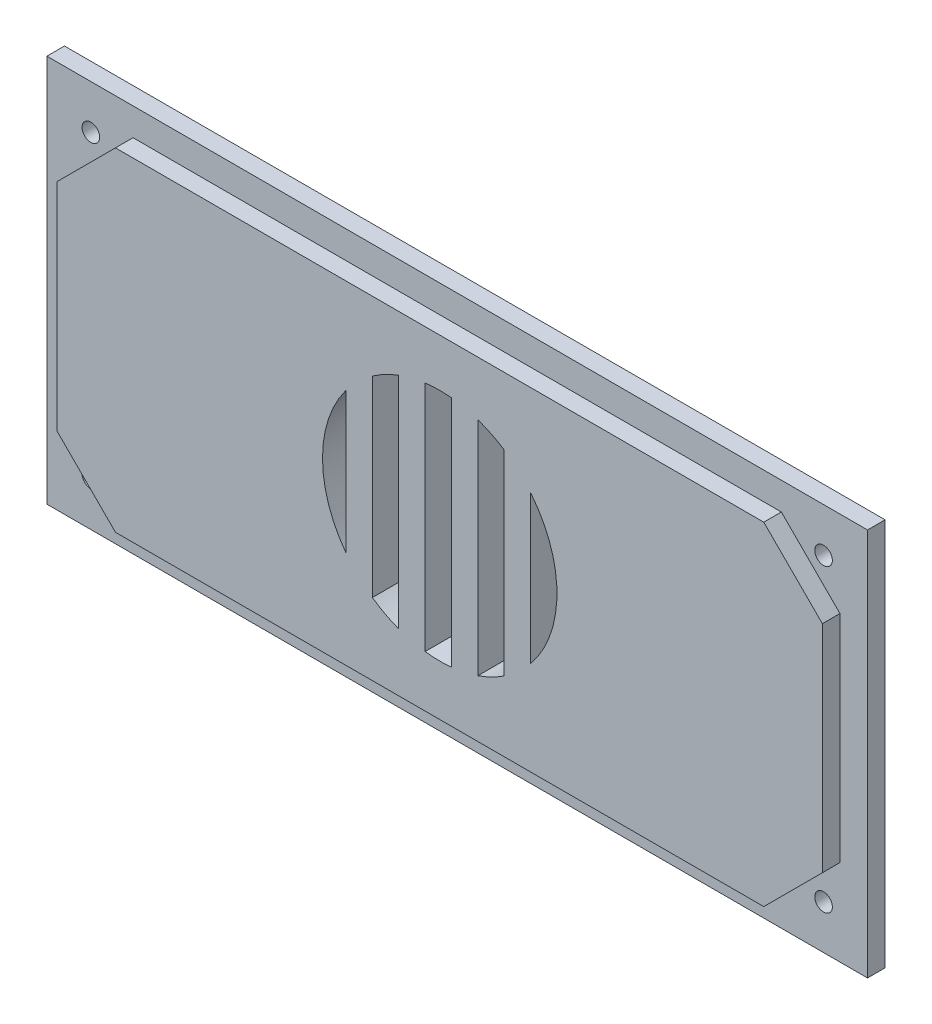
ISO-10303-21;
HEADER;
FILE_DESCRIPTION(('STEP AP214'),'2;1');
FILE_NAME('part.step','',(''),(''),'','','');
FILE_SCHEMA(('AUTOMOTIVE_DESIGN { 1 0 10303 214 1 1 1 1 }'));
ENDSEC;
DATA;
#1=APPLICATION_CONTEXT('core data for automotive mechanical design processes');
#2=APPLICATION_PROTOCOL_DEFINITION('international standard','automotive_design',2000,#1);
#3=PRODUCT_CONTEXT('',#1,'mechanical');
#4=PRODUCT('Part','Part','',(#3));
#5=PRODUCT_RELATED_PRODUCT_CATEGORY('part','',(#4));
#6=PRODUCT_DEFINITION_FORMATION('','',#4);
#7=PRODUCT_DEFINITION_CONTEXT('part definition',#1,'design');
#8=PRODUCT_DEFINITION('design','',#6,#7);
#9=PRODUCT_DEFINITION_SHAPE('','',#8);
#10=(LENGTH_UNIT() NAMED_UNIT(*) SI_UNIT(.MILLI.,.METRE.));
#11=(NAMED_UNIT(*) PLANE_ANGLE_UNIT() SI_UNIT($,.RADIAN.));
#12=(NAMED_UNIT(*) SI_UNIT($,.STERADIAN.) SOLID_ANGLE_UNIT());
#13=UNCERTAINTY_MEASURE_WITH_UNIT(LENGTH_MEASURE(1.E-05),#10,'distance_accuracy_value','');
#14=(GEOMETRIC_REPRESENTATION_CONTEXT(3) GLOBAL_UNCERTAINTY_ASSIGNED_CONTEXT((#13)) GLOBAL_UNIT_ASSIGNED_CONTEXT((#10,
#11,#12)) REPRESENTATION_CONTEXT('',''));
#15=CARTESIAN_POINT('',(0.,0.,0.));
#16=DIRECTION('',(0.,0.,1.));
#17=DIRECTION('',(1.,0.,0.));
#18=AXIS2_PLACEMENT_3D('',#15,#16,#17);
#19=CARTESIAN_POINT('',(62.5,-25.6,3.));
#20=DIRECTION('',(0.,0.,-1.));
#21=DIRECTION('',(-1.,0.,0.));
#22=AXIS2_PLACEMENT_3D('',#19,#20,#21);
#23=CYLINDRICAL_SURFACE('',#22,1.50000000000002);
#24=CARTESIAN_POINT('',(62.5,-25.6,-3.));
#25=DIRECTION('',(0.,0.,-1.));
#26=DIRECTION('',(-1.,0.,0.));
#27=AXIS2_PLACEMENT_3D('',#24,#25,#26);
#28=CIRCLE('',#27,1.50000000000002);
#29=CARTESIAN_POINT('',(61.,-25.6,-3.));
#30=VERTEX_POINT('',#29);
#31=EDGE_CURVE('E297',#30,#30,#28,.T.);
#32=ORIENTED_EDGE('',*,*,#31,.T.);
#33=EDGE_LOOP('',(#32));
#34=FACE_BOUND('',#33,.T.);
#35=CARTESIAN_POINT('',(62.5,-25.6,0.));
#36=DIRECTION('',(0.,0.,1.));
#37=DIRECTION('',(1.,0.,0.));
#38=AXIS2_PLACEMENT_3D('',#35,#36,#37);
#39=CIRCLE('',#38,1.50000000000002);
#40=CARTESIAN_POINT('',(64.,-25.6,0.));
#41=VERTEX_POINT('',#40);
#42=EDGE_CURVE('E36',#41,#41,#39,.F.);
#43=ORIENTED_EDGE('',*,*,#42,.F.);
#44=EDGE_LOOP('',(#43));
#45=FACE_BOUND('',#44,.T.);
#46=ADVANCED_FACE('F32',(#34,#45),#23,.F.);
#47=CARTESIAN_POINT('',(-62.5,-25.6,3.));
#48=DIRECTION('',(0.,0.,-1.));
#49=DIRECTION('',(-1.,0.,0.));
#50=AXIS2_PLACEMENT_3D('',#47,#48,#49);
#51=CYLINDRICAL_SURFACE('',#50,1.49999999999999);
#52=CARTESIAN_POINT('',(-62.5,-25.6,-3.));
#53=DIRECTION('',(0.,0.,-1.));
#54=DIRECTION('',(-1.,0.,0.));
#55=AXIS2_PLACEMENT_3D('',#52,#53,#54);
#56=CIRCLE('',#55,1.49999999999999);
#57=CARTESIAN_POINT('',(-64.,-25.6,-3.));
#58=VERTEX_POINT('',#57);
#59=EDGE_CURVE('E321',#58,#58,#56,.T.);
#60=ORIENTED_EDGE('',*,*,#59,.T.);
#61=EDGE_LOOP('',(#60));
#62=FACE_BOUND('',#61,.T.);
#63=CARTESIAN_POINT('',(-62.5,-25.6,0.));
#64=DIRECTION('',(0.,0.,1.));
#65=DIRECTION('',(1.,0.,0.));
#66=AXIS2_PLACEMENT_3D('',#63,#64,#65);
#67=CIRCLE('',#66,1.49999999999999);
#68=CARTESIAN_POINT('',(-61.,-25.6,0.));
#69=VERTEX_POINT('',#68);
#70=EDGE_CURVE('E301',#69,#69,#67,.F.);
#71=ORIENTED_EDGE('',*,*,#70,.F.);
#72=EDGE_LOOP('',(#71));
#73=FACE_BOUND('',#72,.T.);
#74=ADVANCED_FACE('F461',(#62,#73),#51,.F.);
#75=CARTESIAN_POINT('',(-62.5,25.6,3.));
#76=DIRECTION('',(0.,0.,-1.));
#77=DIRECTION('',(-1.,0.,0.));
#78=AXIS2_PLACEMENT_3D('',#75,#76,#77);
#79=CYLINDRICAL_SURFACE('',#78,1.49999999999999);
#80=CARTESIAN_POINT('',(-62.5,25.6,-3.));
#81=DIRECTION('',(0.,0.,-1.));
#82=DIRECTION('',(-1.,0.,0.));
#83=AXIS2_PLACEMENT_3D('',#80,#81,#82);
#84=CIRCLE('',#83,1.49999999999999);
#85=CARTESIAN_POINT('',(-64.,25.6,-3.));
#86=VERTEX_POINT('',#85);
#87=EDGE_CURVE('E317',#86,#86,#84,.T.);
#88=ORIENTED_EDGE('',*,*,#87,.T.);
#89=EDGE_LOOP('',(#88));
#90=FACE_BOUND('',#89,.T.);
#91=CARTESIAN_POINT('',(-62.5,25.6,0.));
#92=DIRECTION('',(0.,0.,1.));
#93=DIRECTION('',(1.,0.,0.));
#94=AXIS2_PLACEMENT_3D('',#91,#92,#93);
#95=CIRCLE('',#94,1.49999999999999);
#96=CARTESIAN_POINT('',(-61.,25.6,0.));
#97=VERTEX_POINT('',#96);
#98=EDGE_CURVE('E299',#97,#97,#95,.F.);
#99=ORIENTED_EDGE('',*,*,#98,.F.);
#100=EDGE_LOOP('',(#99));
#101=FACE_BOUND('',#100,.T.);
#102=ADVANCED_FACE('F467',(#90,#101),#79,.F.);
#103=CARTESIAN_POINT('',(62.5,25.6,3.));
#104=DIRECTION('',(0.,0.,-1.));
#105=DIRECTION('',(-1.,0.,0.));
#106=AXIS2_PLACEMENT_3D('',#103,#104,#105);
#107=CYLINDRICAL_SURFACE('',#106,1.50000000000002);
#108=CARTESIAN_POINT('',(62.5,25.6,-3.));
#109=DIRECTION('',(0.,0.,-1.));
#110=DIRECTION('',(-1.,0.,0.));
#111=AXIS2_PLACEMENT_3D('',#108,#109,#110);
#112=CIRCLE('',#111,1.50000000000002);
#113=CARTESIAN_POINT('',(61.,25.6,-3.));
#114=VERTEX_POINT('',#113);
#115=EDGE_CURVE('E320',#114,#114,#112,.T.);
#116=ORIENTED_EDGE('',*,*,#115,.T.);
#117=EDGE_LOOP('',(#116));
#118=FACE_BOUND('',#117,.T.);
#119=CARTESIAN_POINT('',(62.5,25.6,0.));
#120=DIRECTION('',(0.,0.,1.));
#121=DIRECTION('',(1.,0.,0.));
#122=AXIS2_PLACEMENT_3D('',#119,#120,#121);
#123=CIRCLE('',#122,1.50000000000002);
#124=CARTESIAN_POINT('',(64.,25.6,0.));
#125=VERTEX_POINT('',#124);
#126=EDGE_CURVE('E294',#125,#125,#123,.F.);
#127=ORIENTED_EDGE('',*,*,#126,.F.);
#128=EDGE_LOOP('',(#127));
#129=FACE_BOUND('',#128,.T.);
#130=ADVANCED_FACE('F473',(#118,#129),#107,.F.);
#131=CARTESIAN_POINT('',(0.,0.,-3.));
#132=DIRECTION('',(0.,0.,1.));
#133=DIRECTION('',(1.,0.,0.));
#134=AXIS2_PLACEMENT_3D('',#131,#132,#133);
#135=PLANE('',#134);
#136=ORIENTED_EDGE('',*,*,#87,.F.);
#137=EDGE_LOOP('',(#136));
#138=FACE_BOUND('',#137,.T.);
#139=ORIENTED_EDGE('',*,*,#59,.F.);
#140=EDGE_LOOP('',(#139));
#141=FACE_BOUND('',#140,.T.);
#142=ORIENTED_EDGE('',*,*,#31,.F.);
#143=EDGE_LOOP('',(#142));
#144=FACE_BOUND('',#143,.T.);
#145=ORIENTED_EDGE('',*,*,#115,.F.);
#146=EDGE_LOOP('',(#145));
#147=FACE_BOUND('',#146,.T.);
#148=DIRECTION('',(0.,-1.,0.));
#149=VECTOR('',#148,1.);
#150=CARTESIAN_POINT('',(-2.48024191109036,0.,-3.));
#151=LINE('',#150,#149);
#152=CARTESIAN_POINT('',(-2.48024191109036,20.074922517825,-3.));
#153=VERTEX_POINT('',#152);
#154=CARTESIAN_POINT('',(-2.48024191109036,-19.6113471481438,-3.));
#155=VERTEX_POINT('',#154);
#156=EDGE_CURVE('E366',#153,#155,#151,.T.);
#157=ORIENTED_EDGE('',*,*,#156,.T.);
#158=CARTESIAN_POINT('',(0.0197580889096383,0.231787684840584,-3.));
#159=DIRECTION('',(0.,0.,-1.));
#160=DIRECTION('',(-1.,0.,0.));
#161=AXIS2_PLACEMENT_3D('',#158,#159,#160);
#162=CIRCLE('',#161,20.);
#163=CARTESIAN_POINT('',(2.01975808890964,-19.6679610572918,-3.));
#164=VERTEX_POINT('',#163);
#165=EDGE_CURVE('E359',#164,#155,#162,.T.);
#166=ORIENTED_EDGE('',*,*,#165,.F.);
#167=DIRECTION('',(0.,-1.,0.));
#168=VECTOR('',#167,1.);
#169=CARTESIAN_POINT('',(2.01975808890964,0.,-3.));
#170=LINE('',#169,#168);
#171=CARTESIAN_POINT('',(2.01975808890964,20.131536426973,-3.));
#172=VERTEX_POINT('',#171);
#173=EDGE_CURVE('E373',#172,#164,#170,.T.);
#174=ORIENTED_EDGE('',*,*,#173,.F.);
#175=EDGE_CURVE('E369',#153,#172,#162,.T.);
#176=ORIENTED_EDGE('',*,*,#175,.F.);
#177=EDGE_LOOP('',(#157,#166,#174,#176));
#178=FACE_BOUND('',#177,.T.);
#179=DIRECTION('',(0.,-1.,0.));
#180=VECTOR('',#179,1.);
#181=CARTESIAN_POINT('',(15.5197580889096,0.,-3.));
#182=LINE('',#181,#180);
#183=CARTESIAN_POINT('',(15.5197580889096,12.8710123446051,-3.));
#184=VERTEX_POINT('',#183);
#185=CARTESIAN_POINT('',(15.5197580889096,-12.407436974924,-3.));
#186=VERTEX_POINT('',#185);
#187=EDGE_CURVE('E349',#184,#186,#182,.T.);
#188=ORIENTED_EDGE('',*,*,#187,.T.);
#189=CARTESIAN_POINT('',(0.0197580889096383,0.231787684840584,-3.));
#190=DIRECTION('',(0.,0.,-1.));
#191=DIRECTION('',(-1.,0.,0.));
#192=AXIS2_PLACEMENT_3D('',#189,#190,#191);
#193=CIRCLE('',#192,20.);
#194=EDGE_CURVE('E430',#184,#186,#193,.T.);
#195=ORIENTED_EDGE('',*,*,#194,.F.);
#196=EDGE_LOOP('',(#188,#195));
#197=FACE_BOUND('',#196,.T.);
#198=DIRECTION('',(0.,1.,0.));
#199=VECTOR('',#198,1.);
#200=CARTESIAN_POINT('',(70.,33.1,-3.));
#201=LINE('',#200,#199);
#202=CARTESIAN_POINT('',(70.,-33.1,-3.));
#203=VERTEX_POINT('',#202);
#204=CARTESIAN_POINT('',(70.,33.1,-3.));
#205=VERTEX_POINT('',#204);
#206=EDGE_CURVE('E266',#203,#205,#201,.T.);
#207=ORIENTED_EDGE('',*,*,#206,.F.);
#208=DIRECTION('',(1.,0.,0.));
#209=VECTOR('',#208,1.);
#210=CARTESIAN_POINT('',(-70.,-33.1,-3.));
#211=LINE('',#210,#209);
#212=CARTESIAN_POINT('',(-70.,-33.1,-3.));
#213=VERTEX_POINT('',#212);
#214=EDGE_CURVE('E276',#213,#203,#211,.T.);
#215=ORIENTED_EDGE('',*,*,#214,.F.);
#216=DIRECTION('',(0.,-1.,0.));
#217=VECTOR('',#216,1.);
#218=CARTESIAN_POINT('',(-70.,33.1,-3.));
#219=LINE('',#218,#217);
#220=CARTESIAN_POINT('',(-70.,33.1,-3.));
#221=VERTEX_POINT('',#220);
#222=EDGE_CURVE('E273',#221,#213,#219,.T.);
#223=ORIENTED_EDGE('',*,*,#222,.F.);
#224=DIRECTION('',(-1.,0.,0.));
#225=VECTOR('',#224,1.);
#226=CARTESIAN_POINT('',(-70.,33.1,-3.));
#227=LINE('',#226,#225);
#228=EDGE_CURVE('E269',#205,#221,#227,.T.);
#229=ORIENTED_EDGE('',*,*,#228,.F.);
#230=EDGE_LOOP('',(#207,#215,#223,#229));
#231=FACE_BOUND('',#230,.T.);
#232=DIRECTION('',(0.,-1.,0.));
#233=VECTOR('',#232,1.);
#234=CARTESIAN_POINT('',(-15.9802419110904,0.,-3.));
#235=LINE('',#234,#233);
#236=CARTESIAN_POINT('',(-15.9802419110904,12.2317876848406,-3.));
#237=VERTEX_POINT('',#236);
#238=CARTESIAN_POINT('',(-15.9802419110904,-11.7682123151594,-3.));
#239=VERTEX_POINT('',#238);
#240=EDGE_CURVE('E416',#237,#239,#235,.T.);
#241=ORIENTED_EDGE('',*,*,#240,.F.);
#242=CARTESIAN_POINT('',(0.0197580889096383,0.231787684840584,-3.));
#243=DIRECTION('',(0.,0.,-1.));
#244=DIRECTION('',(-1.,0.,0.));
#245=AXIS2_PLACEMENT_3D('',#242,#243,#244);
#246=CIRCLE('',#245,20.);
#247=EDGE_CURVE('E328',#239,#237,#246,.T.);
#248=ORIENTED_EDGE('',*,*,#247,.F.);
#249=EDGE_LOOP('',(#241,#248));
#250=FACE_BOUND('',#249,.T.);
#251=DIRECTION('',(0.,-1.,0.));
#252=VECTOR('',#251,1.);
#253=CARTESIAN_POINT('',(-11.4802419110904,0.,-3.));
#254=LINE('',#253,#252);
#255=CARTESIAN_POINT('',(-11.4802419110904,16.5948558567942,-3.));
#256=VERTEX_POINT('',#255);
#257=CARTESIAN_POINT('',(-11.4802419110904,-16.131280487113,-3.));
#258=VERTEX_POINT('',#257);
#259=EDGE_CURVE('E394',#256,#258,#254,.T.);
#260=ORIENTED_EDGE('',*,*,#259,.T.);
#261=CARTESIAN_POINT('',(0.0197580889096383,0.231787684840584,-3.));
#262=DIRECTION('',(0.,0.,-1.));
#263=DIRECTION('',(-1.,0.,0.));
#264=AXIS2_PLACEMENT_3D('',#261,#262,#263);
#265=CIRCLE('',#264,20.);
#266=CARTESIAN_POINT('',(-6.98024191109035,-18.5032063103546,-3.));
#267=VERTEX_POINT('',#266);
#268=EDGE_CURVE('E387',#267,#258,#265,.T.);
#269=ORIENTED_EDGE('',*,*,#268,.F.);
#270=DIRECTION('',(0.,-1.,0.));
#271=VECTOR('',#270,1.);
#272=CARTESIAN_POINT('',(-6.98024191109035,0.,-3.));
#273=LINE('',#272,#271);
#274=CARTESIAN_POINT('',(-6.98024191109035,18.9667816800358,-3.));
#275=VERTEX_POINT('',#274);
#276=EDGE_CURVE('E401',#275,#267,#273,.T.);
#277=ORIENTED_EDGE('',*,*,#276,.F.);
#278=EDGE_CURVE('E397',#256,#275,#265,.T.);
#279=ORIENTED_EDGE('',*,*,#278,.F.);
#280=EDGE_LOOP('',(#260,#269,#277,#279));
#281=FACE_BOUND('',#280,.T.);
#282=DIRECTION('',(0.,-1.,0.));
#283=VECTOR('',#282,1.);
#284=CARTESIAN_POINT('',(6.51975808890964,0.,-3.));
#285=LINE('',#284,#283);
#286=CARTESIAN_POINT('',(6.51975808890964,19.1460680042183,-3.));
#287=VERTEX_POINT('',#286);
#288=CARTESIAN_POINT('',(6.51975808890964,-18.6824926345372,-3.));
#289=VERTEX_POINT('',#288);
#290=EDGE_CURVE('E57',#287,#289,#285,.T.);
#291=ORIENTED_EDGE('',*,*,#290,.T.);
#292=CARTESIAN_POINT('',(0.0197580889096383,0.231787684840584,-3.));
#293=DIRECTION('',(0.,0.,-1.));
#294=DIRECTION('',(-1.,0.,0.));
#295=AXIS2_PLACEMENT_3D('',#292,#293,#294);
#296=CIRCLE('',#295,20.);
#297=CARTESIAN_POINT('',(11.0197580889096,-16.4715054036495,-3.));
#298=VERTEX_POINT('',#297);
#299=EDGE_CURVE('E332',#298,#289,#296,.T.);
#300=ORIENTED_EDGE('',*,*,#299,.F.);
#301=DIRECTION('',(0.,-1.,0.));
#302=VECTOR('',#301,1.);
#303=CARTESIAN_POINT('',(11.0197580889096,0.,-3.));
#304=LINE('',#303,#302);
#305=CARTESIAN_POINT('',(11.0197580889096,16.9350807733307,-3.));
#306=VERTEX_POINT('',#305);
#307=EDGE_CURVE('E344',#306,#298,#304,.T.);
#308=ORIENTED_EDGE('',*,*,#307,.F.);
#309=EDGE_CURVE('E340',#287,#306,#296,.T.);
#310=ORIENTED_EDGE('',*,*,#309,.F.);
#311=EDGE_LOOP('',(#291,#300,#308,#310));
#312=FACE_BOUND('',#311,.T.);
#313=ADVANCED_FACE('F444',(#138,#141,#144,#147,#178,#197,#231,#250,#281,#312),#135,.F.);
#314=CARTESIAN_POINT('',(0.,0.,3.));
#315=DIRECTION('',(0.,0.,1.));
#316=DIRECTION('',(1.,0.,0.));
#317=AXIS2_PLACEMENT_3D('',#314,#315,#316);
#318=PLANE('',#317);
#319=DIRECTION('',(-0.707106781186548,-0.707106781186548,0.));
#320=VECTOR('',#319,1.);
#321=CARTESIAN_POINT('',(65.3,-18.4,3.));
#322=LINE('',#321,#320);
#323=CARTESIAN_POINT('',(65.3,-18.4,3.));
#324=VERTEX_POINT('',#323);
#325=CARTESIAN_POINT('',(55.3,-28.4,3.));
#326=VERTEX_POINT('',#325);
#327=EDGE_CURVE('E219',#324,#326,#322,.T.);
#328=ORIENTED_EDGE('',*,*,#327,.F.);
#329=DIRECTION('',(0.,1.,0.));
#330=VECTOR('',#329,1.);
#331=CARTESIAN_POINT('',(65.3,28.4,3.));
#332=LINE('',#331,#330);
#333=CARTESIAN_POINT('',(65.3,18.4,3.));
#334=VERTEX_POINT('',#333);
#335=EDGE_CURVE('E230',#324,#334,#332,.T.);
#336=ORIENTED_EDGE('',*,*,#335,.T.);
#337=DIRECTION('',(0.707106781186548,-0.707106781186548,0.));
#338=VECTOR('',#337,1.);
#339=CARTESIAN_POINT('',(55.3,28.4,3.));
#340=LINE('',#339,#338);
#341=CARTESIAN_POINT('',(55.3,28.4,3.));
#342=VERTEX_POINT('',#341);
#343=EDGE_CURVE('E306',#342,#334,#340,.T.);
#344=ORIENTED_EDGE('',*,*,#343,.F.);
#345=DIRECTION('',(-1.,0.,0.));
#346=VECTOR('',#345,1.);
#347=CARTESIAN_POINT('',(-65.3,28.4,3.));
#348=LINE('',#347,#346);
#349=CARTESIAN_POINT('',(-55.3,28.4,3.));
#350=VERTEX_POINT('',#349);
#351=EDGE_CURVE('E241',#342,#350,#348,.T.);
#352=ORIENTED_EDGE('',*,*,#351,.T.);
#353=DIRECTION('',(0.707106781186548,0.707106781186548,0.));
#354=VECTOR('',#353,1.);
#355=CARTESIAN_POINT('',(-65.3,18.4,3.));
#356=LINE('',#355,#354);
#357=CARTESIAN_POINT('',(-65.3,18.4,3.));
#358=VERTEX_POINT('',#357);
#359=EDGE_CURVE('E824',#358,#350,#356,.T.);
#360=ORIENTED_EDGE('',*,*,#359,.F.);
#361=DIRECTION('',(0.,-1.,0.));
#362=VECTOR('',#361,1.);
#363=CARTESIAN_POINT('',(-65.3,28.4,3.));
#364=LINE('',#363,#362);
#365=CARTESIAN_POINT('',(-65.3,-18.4,3.));
#366=VERTEX_POINT('',#365);
#367=EDGE_CURVE('E245',#358,#366,#364,.T.);
#368=ORIENTED_EDGE('',*,*,#367,.T.);
#369=DIRECTION('',(-0.707106781186548,0.707106781186548,0.));
#370=VECTOR('',#369,1.);
#371=CARTESIAN_POINT('',(-55.3,-28.4,3.));
#372=LINE('',#371,#370);
#373=CARTESIAN_POINT('',(-55.3,-28.4,3.));
#374=VERTEX_POINT('',#373);
#375=EDGE_CURVE('E813',#374,#366,#372,.T.);
#376=ORIENTED_EDGE('',*,*,#375,.F.);
#377=DIRECTION('',(1.,0.,0.));
#378=VECTOR('',#377,1.);
#379=CARTESIAN_POINT('',(-65.3,-28.4,3.));
#380=LINE('',#379,#378);
#381=EDGE_CURVE('E234',#374,#326,#380,.T.);
#382=ORIENTED_EDGE('',*,*,#381,.T.);
#383=EDGE_LOOP('',(#328,#336,#344,#352,#360,#368,#376,#382));
#384=FACE_BOUND('',#383,.T.);
#385=CARTESIAN_POINT('',(0.0197580889096383,0.231787684840584,3.));
#386=DIRECTION('',(0.,0.,-1.));
#387=DIRECTION('',(-1.,0.,0.));
#388=AXIS2_PLACEMENT_3D('',#385,#386,#387);
#389=CIRCLE('',#388,20.);
#390=CARTESIAN_POINT('',(-15.9802419110904,-11.7682123151594,3.));
#391=VERTEX_POINT('',#390);
#392=CARTESIAN_POINT('',(-15.9802419110904,12.2317876848406,3.));
#393=VERTEX_POINT('',#392);
#394=EDGE_CURVE('E412',#391,#393,#389,.T.);
#395=ORIENTED_EDGE('',*,*,#394,.T.);
#396=DIRECTION('',(0.,-1.,0.));
#397=VECTOR('',#396,1.);
#398=CARTESIAN_POINT('',(-15.9802419110904,0.,3.));
#399=LINE('',#398,#397);
#400=EDGE_CURVE('E415',#393,#391,#399,.T.);
#401=ORIENTED_EDGE('',*,*,#400,.T.);
#402=EDGE_LOOP('',(#395,#401));
#403=FACE_BOUND('',#402,.T.);
#404=CARTESIAN_POINT('',(0.0197580889096383,0.231787684840584,3.));
#405=DIRECTION('',(0.,0.,-1.));
#406=DIRECTION('',(-1.,0.,0.));
#407=AXIS2_PLACEMENT_3D('',#404,#405,#406);
#408=CIRCLE('',#407,20.);
#409=CARTESIAN_POINT('',(15.5197580889096,12.8710123446051,3.));
#410=VERTEX_POINT('',#409);
#411=CARTESIAN_POINT('',(15.5197580889096,-12.407436974924,3.));
#412=VERTEX_POINT('',#411);
#413=EDGE_CURVE('E429',#410,#412,#408,.T.);
#414=ORIENTED_EDGE('',*,*,#413,.T.);
#415=DIRECTION('',(0.,-1.,0.));
#416=VECTOR('',#415,1.);
#417=CARTESIAN_POINT('',(15.5197580889096,0.,3.));
#418=LINE('',#417,#416);
#419=EDGE_CURVE('E426',#410,#412,#418,.T.);
#420=ORIENTED_EDGE('',*,*,#419,.F.);
#421=EDGE_LOOP('',(#414,#420));
#422=FACE_BOUND('',#421,.T.);
#423=CARTESIAN_POINT('',(0.0197580889096383,0.231787684840584,3.));
#424=DIRECTION('',(0.,0.,-1.));
#425=DIRECTION('',(-1.,0.,0.));
#426=AXIS2_PLACEMENT_3D('',#423,#424,#425);
#427=CIRCLE('',#426,20.);
#428=CARTESIAN_POINT('',(-6.98024191109035,-18.5032063103546,3.));
#429=VERTEX_POINT('',#428);
#430=CARTESIAN_POINT('',(-11.4802419110904,-16.131280487113,3.));
#431=VERTEX_POINT('',#430);
#432=EDGE_CURVE('E391',#429,#431,#427,.T.);
#433=ORIENTED_EDGE('',*,*,#432,.T.);
#434=DIRECTION('',(0.,-1.,0.));
#435=VECTOR('',#434,1.);
#436=CARTESIAN_POINT('',(-11.4802419110904,0.,3.));
#437=LINE('',#436,#435);
#438=CARTESIAN_POINT('',(-11.4802419110904,16.5948558567942,3.));
#439=VERTEX_POINT('',#438);
#440=EDGE_CURVE('E384',#439,#431,#437,.T.);
#441=ORIENTED_EDGE('',*,*,#440,.F.);
#442=CARTESIAN_POINT('',(-6.98024191109035,18.9667816800358,3.));
#443=VERTEX_POINT('',#442);
#444=EDGE_CURVE('E386',#439,#443,#427,.T.);
#445=ORIENTED_EDGE('',*,*,#444,.T.);
#446=DIRECTION('',(0.,-1.,0.));
#447=VECTOR('',#446,1.);
#448=CARTESIAN_POINT('',(-6.98024191109035,0.,3.));
#449=LINE('',#448,#447);
#450=EDGE_CURVE('E390',#443,#429,#449,.T.);
#451=ORIENTED_EDGE('',*,*,#450,.T.);
#452=EDGE_LOOP('',(#433,#441,#445,#451));
#453=FACE_BOUND('',#452,.T.);
#454=CARTESIAN_POINT('',(0.0197580889096383,0.231787684840584,3.));
#455=DIRECTION('',(0.,0.,-1.));
#456=DIRECTION('',(-1.,0.,0.));
#457=AXIS2_PLACEMENT_3D('',#454,#455,#456);
#458=CIRCLE('',#457,20.);
#459=CARTESIAN_POINT('',(2.01975808890964,-19.6679610572918,3.));
#460=VERTEX_POINT('',#459);
#461=CARTESIAN_POINT('',(-2.48024191109036,-19.6113471481438,3.));
#462=VERTEX_POINT('',#461);
#463=EDGE_CURVE('E363',#460,#462,#458,.T.);
#464=ORIENTED_EDGE('',*,*,#463,.T.);
#465=DIRECTION('',(0.,-1.,0.));
#466=VECTOR('',#465,1.);
#467=CARTESIAN_POINT('',(-2.48024191109036,0.,3.));
#468=LINE('',#467,#466);
#469=CARTESIAN_POINT('',(-2.48024191109036,20.074922517825,3.));
#470=VERTEX_POINT('',#469);
#471=EDGE_CURVE('E356',#470,#462,#468,.T.);
#472=ORIENTED_EDGE('',*,*,#471,.F.);
#473=CARTESIAN_POINT('',(2.01975808890964,20.131536426973,3.));
#474=VERTEX_POINT('',#473);
#475=EDGE_CURVE('E358',#470,#474,#458,.T.);
#476=ORIENTED_EDGE('',*,*,#475,.T.);
#477=DIRECTION('',(0.,-1.,0.));
#478=VECTOR('',#477,1.);
#479=CARTESIAN_POINT('',(2.01975808890964,0.,3.));
#480=LINE('',#479,#478);
#481=EDGE_CURVE('E362',#474,#460,#480,.T.);
#482=ORIENTED_EDGE('',*,*,#481,.T.);
#483=EDGE_LOOP('',(#464,#472,#476,#482));
#484=FACE_BOUND('',#483,.T.);
#485=CARTESIAN_POINT('',(0.0197580889096383,0.231787684840584,3.));
#486=DIRECTION('',(0.,0.,-1.));
#487=DIRECTION('',(-1.,0.,0.));
#488=AXIS2_PLACEMENT_3D('',#485,#486,#487);
#489=CIRCLE('',#488,20.);
#490=CARTESIAN_POINT('',(11.0197580889096,-16.4715054036495,3.));
#491=VERTEX_POINT('',#490);
#492=CARTESIAN_POINT('',(6.51975808890964,-18.6824926345372,3.));
#493=VERTEX_POINT('',#492);
#494=EDGE_CURVE('E336',#491,#493,#489,.T.);
#495=ORIENTED_EDGE('',*,*,#494,.T.);
#496=DIRECTION('',(0.,-1.,0.));
#497=VECTOR('',#496,1.);
#498=CARTESIAN_POINT('',(6.51975808890964,0.,3.));
#499=LINE('',#498,#497);
#500=CARTESIAN_POINT('',(6.51975808890964,19.1460680042183,3.));
#501=VERTEX_POINT('',#500);
#502=EDGE_CURVE('E329',#501,#493,#499,.T.);
#503=ORIENTED_EDGE('',*,*,#502,.F.);
#504=CARTESIAN_POINT('',(11.0197580889096,16.9350807733307,3.));
#505=VERTEX_POINT('',#504);
#506=EDGE_CURVE('E331',#501,#505,#489,.T.);
#507=ORIENTED_EDGE('',*,*,#506,.T.);
#508=DIRECTION('',(0.,-1.,0.));
#509=VECTOR('',#508,1.);
#510=CARTESIAN_POINT('',(11.0197580889096,0.,3.));
#511=LINE('',#510,#509);
#512=EDGE_CURVE('E335',#505,#491,#511,.T.);
#513=ORIENTED_EDGE('',*,*,#512,.T.);
#514=EDGE_LOOP('',(#495,#503,#507,#513));
#515=FACE_BOUND('',#514,.T.);
#516=ADVANCED_FACE('F227',(#384,#403,#422,#453,#484,#515),#318,.T.);
#517=CARTESIAN_POINT('',(0.,0.,0.));
#518=DIRECTION('',(0.,0.,1.));
#519=DIRECTION('',(1.,0.,0.));
#520=AXIS2_PLACEMENT_3D('',#517,#518,#519);
#521=PLANE('',#520);
#522=DIRECTION('',(0.,1.,0.));
#523=VECTOR('',#522,1.);
#524=CARTESIAN_POINT('',(65.3,28.4,0.));
#525=LINE('',#524,#523);
#526=CARTESIAN_POINT('',(65.3,-18.4,0.));
#527=VERTEX_POINT('',#526);
#528=CARTESIAN_POINT('',(65.3,18.4,0.));
#529=VERTEX_POINT('',#528);
#530=EDGE_CURVE('E258',#527,#529,#525,.T.);
#531=ORIENTED_EDGE('',*,*,#530,.F.);
#532=DIRECTION('',(0.707106781186548,0.707106781186548,0.));
#533=VECTOR('',#532,1.);
#534=CARTESIAN_POINT('',(65.3,-18.4,0.));
#535=LINE('',#534,#533);
#536=CARTESIAN_POINT('',(55.3,-28.4,0.));
#537=VERTEX_POINT('',#536);
#538=EDGE_CURVE('E220',#537,#527,#535,.T.);
#539=ORIENTED_EDGE('',*,*,#538,.F.);
#540=DIRECTION('',(1.,0.,0.));
#541=VECTOR('',#540,1.);
#542=CARTESIAN_POINT('',(-65.3,-28.4,0.));
#543=LINE('',#542,#541);
#544=CARTESIAN_POINT('',(-55.3,-28.4,0.));
#545=VERTEX_POINT('',#544);
#546=EDGE_CURVE('E242',#545,#537,#543,.T.);
#547=ORIENTED_EDGE('',*,*,#546,.F.);
#548=DIRECTION('',(0.707106781186548,-0.707106781186548,0.));
#549=VECTOR('',#548,1.);
#550=CARTESIAN_POINT('',(-55.3,-28.4,0.));
#551=LINE('',#550,#549);
#552=CARTESIAN_POINT('',(-65.3,-18.4,0.));
#553=VERTEX_POINT('',#552);
#554=EDGE_CURVE('E235',#553,#545,#551,.T.);
#555=ORIENTED_EDGE('',*,*,#554,.F.);
#556=DIRECTION('',(0.,-1.,0.));
#557=VECTOR('',#556,1.);
#558=CARTESIAN_POINT('',(-65.3,28.4,0.));
#559=LINE('',#558,#557);
#560=CARTESIAN_POINT('',(-65.3,18.4,0.));
#561=VERTEX_POINT('',#560);
#562=EDGE_CURVE('E248',#561,#553,#559,.T.);
#563=ORIENTED_EDGE('',*,*,#562,.F.);
#564=DIRECTION('',(-0.707106781186548,-0.707106781186548,0.));
#565=VECTOR('',#564,1.);
#566=CARTESIAN_POINT('',(-65.3,18.4,0.));
#567=LINE('',#566,#565);
#568=CARTESIAN_POINT('',(-55.3,28.4,0.));
#569=VERTEX_POINT('',#568);
#570=EDGE_CURVE('E820',#569,#561,#567,.T.);
#571=ORIENTED_EDGE('',*,*,#570,.F.);
#572=DIRECTION('',(-1.,0.,0.));
#573=VECTOR('',#572,1.);
#574=CARTESIAN_POINT('',(-65.3,28.4,0.));
#575=LINE('',#574,#573);
#576=CARTESIAN_POINT('',(55.3,28.4,0.));
#577=VERTEX_POINT('',#576);
#578=EDGE_CURVE('E260',#577,#569,#575,.T.);
#579=ORIENTED_EDGE('',*,*,#578,.F.);
#580=DIRECTION('',(-0.707106781186548,0.707106781186548,0.));
#581=VECTOR('',#580,1.);
#582=CARTESIAN_POINT('',(55.3,28.4,0.));
#583=LINE('',#582,#581);
#584=EDGE_CURVE('E298',#529,#577,#583,.T.);
#585=ORIENTED_EDGE('',*,*,#584,.F.);
#586=EDGE_LOOP('',(#531,#539,#547,#555,#563,#571,#579,#585));
#587=FACE_BOUND('',#586,.T.);
#588=DIRECTION('',(0.,1.,0.));
#589=VECTOR('',#588,1.);
#590=CARTESIAN_POINT('',(70.,33.1,0.));
#591=LINE('',#590,#589);
#592=CARTESIAN_POINT('',(70.,-33.1,0.));
#593=VERTEX_POINT('',#592);
#594=CARTESIAN_POINT('',(70.,33.1,0.));
#595=VERTEX_POINT('',#594);
#596=EDGE_CURVE('E257',#593,#595,#591,.T.);
#597=ORIENTED_EDGE('',*,*,#596,.T.);
#598=DIRECTION('',(-1.,0.,0.));
#599=VECTOR('',#598,1.);
#600=CARTESIAN_POINT('',(-70.,33.1,0.));
#601=LINE('',#600,#599);
#602=CARTESIAN_POINT('',(-70.,33.1,0.));
#603=VERTEX_POINT('',#602);
#604=EDGE_CURVE('E282',#595,#603,#601,.T.);
#605=ORIENTED_EDGE('',*,*,#604,.T.);
#606=DIRECTION('',(0.,-1.,0.));
#607=VECTOR('',#606,1.);
#608=CARTESIAN_POINT('',(-70.,33.1,0.));
#609=LINE('',#608,#607);
#610=CARTESIAN_POINT('',(-70.,-33.1,0.));
#611=VERTEX_POINT('',#610);
#612=EDGE_CURVE('E285',#603,#611,#609,.T.);
#613=ORIENTED_EDGE('',*,*,#612,.T.);
#614=DIRECTION('',(1.,0.,0.));
#615=VECTOR('',#614,1.);
#616=CARTESIAN_POINT('',(-70.,-33.1,0.));
#617=LINE('',#616,#615);
#618=EDGE_CURVE('E270',#611,#593,#617,.T.);
#619=ORIENTED_EDGE('',*,*,#618,.T.);
#620=EDGE_LOOP('',(#597,#605,#613,#619));
#621=FACE_BOUND('',#620,.T.);
#622=ORIENTED_EDGE('',*,*,#126,.T.);
#623=EDGE_LOOP('',(#622));
#624=FACE_BOUND('',#623,.T.);
#625=ORIENTED_EDGE('',*,*,#70,.T.);
#626=EDGE_LOOP('',(#625));
#627=FACE_BOUND('',#626,.T.);
#628=ORIENTED_EDGE('',*,*,#42,.T.);
#629=EDGE_LOOP('',(#628));
#630=FACE_BOUND('',#629,.T.);
#631=ORIENTED_EDGE('',*,*,#98,.T.);
#632=EDGE_LOOP('',(#631));
#633=FACE_BOUND('',#632,.T.);
#634=ADVANCED_FACE('F548',(#587,#621,#624,#627,#630,#633),#521,.T.);
#635=CARTESIAN_POINT('',(70.,33.1,-3.));
#636=DIRECTION('',(1.,0.,0.));
#637=DIRECTION('',(0.,0.,-1.));
#638=AXIS2_PLACEMENT_3D('',#635,#636,#637);
#639=PLANE('',#638);
#640=ORIENTED_EDGE('',*,*,#596,.F.);
#641=DIRECTION('',(0.,0.,1.));
#642=VECTOR('',#641,1.);
#643=CARTESIAN_POINT('',(70.,-33.1,-3.));
#644=LINE('',#643,#642);
#645=EDGE_CURVE('E11',#203,#593,#644,.T.);
#646=ORIENTED_EDGE('',*,*,#645,.F.);
#647=ORIENTED_EDGE('',*,*,#206,.T.);
#648=DIRECTION('',(0.,0.,1.));
#649=VECTOR('',#648,1.);
#650=CARTESIAN_POINT('',(70.,33.1,-3.));
#651=LINE('',#650,#649);
#652=EDGE_CURVE('E279',#205,#595,#651,.T.);
#653=ORIENTED_EDGE('',*,*,#652,.T.);
#654=EDGE_LOOP('',(#640,#646,#647,#653));
#655=FACE_BOUND('',#654,.T.);
#656=ADVANCED_FACE('F34',(#655),#639,.T.);
#657=CARTESIAN_POINT('',(-70.,-33.1,-3.));
#658=DIRECTION('',(0.,-1.,0.));
#659=DIRECTION('',(0.,0.,-1.));
#660=AXIS2_PLACEMENT_3D('',#657,#658,#659);
#661=PLANE('',#660);
#662=ORIENTED_EDGE('',*,*,#618,.F.);
#663=DIRECTION('',(0.,0.,1.));
#664=VECTOR('',#663,1.);
#665=CARTESIAN_POINT('',(-70.,-33.1,-3.));
#666=LINE('',#665,#664);
#667=EDGE_CURVE('E41',#213,#611,#666,.T.);
#668=ORIENTED_EDGE('',*,*,#667,.F.);
#669=ORIENTED_EDGE('',*,*,#214,.T.);
#670=ORIENTED_EDGE('',*,*,#645,.T.);
#671=EDGE_LOOP('',(#662,#668,#669,#670));
#672=FACE_BOUND('',#671,.T.);
#673=ADVANCED_FACE('F565',(#672),#661,.T.);
#674=CARTESIAN_POINT('',(-70.,33.1,-3.));
#675=DIRECTION('',(-1.,0.,0.));
#676=DIRECTION('',(0.,0.,1.));
#677=AXIS2_PLACEMENT_3D('',#674,#675,#676);
#678=PLANE('',#677);
#679=ORIENTED_EDGE('',*,*,#612,.F.);
#680=DIRECTION('',(0.,0.,1.));
#681=VECTOR('',#680,1.);
#682=CARTESIAN_POINT('',(-70.,33.1,-3.));
#683=LINE('',#682,#681);
#684=EDGE_CURVE('E291',#221,#603,#683,.T.);
#685=ORIENTED_EDGE('',*,*,#684,.F.);
#686=ORIENTED_EDGE('',*,*,#222,.T.);
#687=ORIENTED_EDGE('',*,*,#667,.T.);
#688=EDGE_LOOP('',(#679,#685,#686,#687));
#689=FACE_BOUND('',#688,.T.);
#690=ADVANCED_FACE('F568',(#689),#678,.T.);
#691=CARTESIAN_POINT('',(-70.,33.1,-3.));
#692=DIRECTION('',(0.,1.,0.));
#693=DIRECTION('',(0.,0.,1.));
#694=AXIS2_PLACEMENT_3D('',#691,#692,#693);
#695=PLANE('',#694);
#696=ORIENTED_EDGE('',*,*,#604,.F.);
#697=ORIENTED_EDGE('',*,*,#652,.F.);
#698=ORIENTED_EDGE('',*,*,#228,.T.);
#699=ORIENTED_EDGE('',*,*,#684,.T.);
#700=EDGE_LOOP('',(#696,#697,#698,#699));
#701=FACE_BOUND('',#700,.T.);
#702=ADVANCED_FACE('F563',(#701),#695,.T.);
#703=CARTESIAN_POINT('',(65.3,28.4,3.));
#704=DIRECTION('',(-1.,0.,0.));
#705=DIRECTION('',(0.,0.,1.));
#706=AXIS2_PLACEMENT_3D('',#703,#704,#705);
#707=PLANE('',#706);
#708=ORIENTED_EDGE('',*,*,#335,.F.);
#709=DIRECTION('',(0.,0.,1.));
#710=VECTOR('',#709,1.);
#711=CARTESIAN_POINT('',(65.3,-18.4,-14.142135623731));
#712=LINE('',#711,#710);
#713=EDGE_CURVE('E216',#527,#324,#712,.T.);
#714=ORIENTED_EDGE('',*,*,#713,.F.);
#715=ORIENTED_EDGE('',*,*,#530,.T.);
#716=DIRECTION('',(0.,0.,1.));
#717=VECTOR('',#716,1.);
#718=CARTESIAN_POINT('',(65.3,18.4,-14.142135623731));
#719=LINE('',#718,#717);
#720=EDGE_CURVE('E240',#529,#334,#719,.T.);
#721=ORIENTED_EDGE('',*,*,#720,.T.);
#722=EDGE_LOOP('',(#708,#714,#715,#721));
#723=FACE_BOUND('',#722,.T.);
#724=ADVANCED_FACE('F238',(#723),#707,.F.);
#725=CARTESIAN_POINT('',(-65.3,28.4,3.));
#726=DIRECTION('',(0.,-1.,0.));
#727=DIRECTION('',(0.,0.,-1.));
#728=AXIS2_PLACEMENT_3D('',#725,#726,#727);
#729=PLANE('',#728);
#730=ORIENTED_EDGE('',*,*,#578,.T.);
#731=DIRECTION('',(0.,0.,1.));
#732=VECTOR('',#731,1.);
#733=CARTESIAN_POINT('',(-55.3,28.4,-14.142135623731));
#734=LINE('',#733,#732);
#735=EDGE_CURVE('E823',#569,#350,#734,.T.);
#736=ORIENTED_EDGE('',*,*,#735,.T.);
#737=ORIENTED_EDGE('',*,*,#351,.F.);
#738=DIRECTION('',(0.,0.,1.));
#739=VECTOR('',#738,1.);
#740=CARTESIAN_POINT('',(55.3,28.4,-14.142135623731));
#741=LINE('',#740,#739);
#742=EDGE_CURVE('E309',#577,#342,#741,.T.);
#743=ORIENTED_EDGE('',*,*,#742,.F.);
#744=EDGE_LOOP('',(#730,#736,#737,#743));
#745=FACE_BOUND('',#744,.T.);
#746=ADVANCED_FACE('F557',(#745),#729,.F.);
#747=CARTESIAN_POINT('',(-65.3,28.4,3.));
#748=DIRECTION('',(1.,0.,0.));
#749=DIRECTION('',(0.,0.,-1.));
#750=AXIS2_PLACEMENT_3D('',#747,#748,#749);
#751=PLANE('',#750);
#752=ORIENTED_EDGE('',*,*,#562,.T.);
#753=DIRECTION('',(0.,0.,1.));
#754=VECTOR('',#753,1.);
#755=CARTESIAN_POINT('',(-65.3,-18.4,-14.142135623731));
#756=LINE('',#755,#754);
#757=EDGE_CURVE('E809',#553,#366,#756,.T.);
#758=ORIENTED_EDGE('',*,*,#757,.T.);
#759=ORIENTED_EDGE('',*,*,#367,.F.);
#760=DIRECTION('',(0.,0.,1.));
#761=VECTOR('',#760,1.);
#762=CARTESIAN_POINT('',(-65.3,18.4,-14.142135623731));
#763=LINE('',#762,#761);
#764=EDGE_CURVE('E826',#561,#358,#763,.T.);
#765=ORIENTED_EDGE('',*,*,#764,.F.);
#766=EDGE_LOOP('',(#752,#758,#759,#765));
#767=FACE_BOUND('',#766,.T.);
#768=ADVANCED_FACE('F456',(#767),#751,.F.);
#769=CARTESIAN_POINT('',(-65.3,-28.4,3.));
#770=DIRECTION('',(0.,1.,0.));
#771=DIRECTION('',(0.,0.,1.));
#772=AXIS2_PLACEMENT_3D('',#769,#770,#771);
#773=PLANE('',#772);
#774=ORIENTED_EDGE('',*,*,#546,.T.);
#775=DIRECTION('',(0.,0.,1.));
#776=VECTOR('',#775,1.);
#777=CARTESIAN_POINT('',(55.3,-28.4,-14.142135623731));
#778=LINE('',#777,#776);
#779=EDGE_CURVE('E49',#537,#326,#778,.T.);
#780=ORIENTED_EDGE('',*,*,#779,.T.);
#781=ORIENTED_EDGE('',*,*,#381,.F.);
#782=DIRECTION('',(0.,0.,1.));
#783=VECTOR('',#782,1.);
#784=CARTESIAN_POINT('',(-55.3,-28.4,-14.142135623731));
#785=LINE('',#784,#783);
#786=EDGE_CURVE('E807',#545,#374,#785,.T.);
#787=ORIENTED_EDGE('',*,*,#786,.F.);
#788=EDGE_LOOP('',(#774,#780,#781,#787));
#789=FACE_BOUND('',#788,.T.);
#790=ADVANCED_FACE('F448',(#789),#773,.F.);
#791=CARTESIAN_POINT('',(15.5197580889096,0.,3.));
#792=DIRECTION('',(1.,0.,0.));
#793=DIRECTION('',(0.,0.,-1.));
#794=AXIS2_PLACEMENT_3D('',#791,#792,#793);
#795=PLANE('',#794);
#796=ORIENTED_EDGE('',*,*,#187,.F.);
#797=DIRECTION('',(0.,0.,-1.));
#798=VECTOR('',#797,1.);
#799=CARTESIAN_POINT('',(15.5197580889096,12.8710123446051,3.));
#800=LINE('',#799,#798);
#801=EDGE_CURVE('E251',#410,#184,#800,.T.);
#802=ORIENTED_EDGE('',*,*,#801,.F.);
#803=ORIENTED_EDGE('',*,*,#419,.T.);
#804=DIRECTION('',(0.,0.,-1.));
#805=VECTOR('',#804,1.);
#806=CARTESIAN_POINT('',(15.5197580889096,-12.407436974924,3.));
#807=LINE('',#806,#805);
#808=EDGE_CURVE('E261',#412,#186,#807,.T.);
#809=ORIENTED_EDGE('',*,*,#808,.T.);
#810=EDGE_LOOP('',(#796,#802,#803,#809));
#811=FACE_BOUND('',#810,.T.);
#812=ADVANCED_FACE('F446',(#811),#795,.T.);
#813=CARTESIAN_POINT('',(0.0197580889096383,0.231787684840584,3.));
#814=DIRECTION('',(0.,0.,-1.));
#815=DIRECTION('',(-1.,0.,0.));
#816=AXIS2_PLACEMENT_3D('',#813,#814,#815);
#817=CYLINDRICAL_SURFACE('',#816,20.);
#818=ORIENTED_EDGE('',*,*,#194,.T.);
#819=ORIENTED_EDGE('',*,*,#808,.F.);
#820=ORIENTED_EDGE('',*,*,#413,.F.);
#821=ORIENTED_EDGE('',*,*,#801,.T.);
#822=EDGE_LOOP('',(#818,#819,#820,#821));
#823=FACE_BOUND('',#822,.T.);
#824=ADVANCED_FACE('F441',(#823),#817,.F.);
#825=CARTESIAN_POINT('',(0.0197580889096383,0.231787684840584,3.));
#826=DIRECTION('',(0.,0.,-1.));
#827=DIRECTION('',(-1.,0.,0.));
#828=AXIS2_PLACEMENT_3D('',#825,#826,#827);
#829=CYLINDRICAL_SURFACE('',#828,20.);
#830=ORIENTED_EDGE('',*,*,#247,.T.);
#831=DIRECTION('',(0.,0.,-1.));
#832=VECTOR('',#831,1.);
#833=CARTESIAN_POINT('',(-15.9802419110904,12.2317876848406,3.));
#834=LINE('',#833,#832);
#835=EDGE_CURVE('E419',#393,#237,#834,.T.);
#836=ORIENTED_EDGE('',*,*,#835,.F.);
#837=ORIENTED_EDGE('',*,*,#394,.F.);
#838=DIRECTION('',(0.,0.,-1.));
#839=VECTOR('',#838,1.);
#840=CARTESIAN_POINT('',(-15.9802419110904,-11.7682123151594,3.));
#841=LINE('',#840,#839);
#842=EDGE_CURVE('E398',#391,#239,#841,.T.);
#843=ORIENTED_EDGE('',*,*,#842,.T.);
#844=EDGE_LOOP('',(#830,#836,#837,#843));
#845=FACE_BOUND('',#844,.T.);
#846=ADVANCED_FACE('F454',(#845),#829,.F.);
#847=CARTESIAN_POINT('',(-15.9802419110904,0.,3.));
#848=DIRECTION('',(1.,0.,0.));
#849=DIRECTION('',(0.,0.,-1.));
#850=AXIS2_PLACEMENT_3D('',#847,#848,#849);
#851=PLANE('',#850);
#852=ORIENTED_EDGE('',*,*,#240,.T.);
#853=ORIENTED_EDGE('',*,*,#842,.F.);
#854=ORIENTED_EDGE('',*,*,#400,.F.);
#855=ORIENTED_EDGE('',*,*,#835,.T.);
#856=EDGE_LOOP('',(#852,#853,#854,#855));
#857=FACE_BOUND('',#856,.T.);
#858=ADVANCED_FACE('F514',(#857),#851,.F.);
#859=CARTESIAN_POINT('',(-11.4802419110904,0.,3.));
#860=DIRECTION('',(1.,0.,0.));
#861=DIRECTION('',(0.,0.,-1.));
#862=AXIS2_PLACEMENT_3D('',#859,#860,#861);
#863=PLANE('',#862);
#864=ORIENTED_EDGE('',*,*,#259,.F.);
#865=DIRECTION('',(0.,0.,-1.));
#866=VECTOR('',#865,1.);
#867=CARTESIAN_POINT('',(-11.4802419110904,16.5948558567942,3.));
#868=LINE('',#867,#866);
#869=EDGE_CURVE('E409',#439,#256,#868,.T.);
#870=ORIENTED_EDGE('',*,*,#869,.F.);
#871=ORIENTED_EDGE('',*,*,#440,.T.);
#872=DIRECTION('',(0.,0.,-1.));
#873=VECTOR('',#872,1.);
#874=CARTESIAN_POINT('',(-11.4802419110904,-16.131280487113,3.));
#875=LINE('',#874,#873);
#876=EDGE_CURVE('E370',#431,#258,#875,.T.);
#877=ORIENTED_EDGE('',*,*,#876,.T.);
#878=EDGE_LOOP('',(#864,#870,#871,#877));
#879=FACE_BOUND('',#878,.T.);
#880=ADVANCED_FACE('F507',(#879),#863,.T.);
#881=CARTESIAN_POINT('',(0.0197580889096383,0.231787684840584,3.));
#882=DIRECTION('',(0.,0.,-1.));
#883=DIRECTION('',(-1.,0.,0.));
#884=AXIS2_PLACEMENT_3D('',#881,#882,#883);
#885=CYLINDRICAL_SURFACE('',#884,20.);
#886=ORIENTED_EDGE('',*,*,#268,.T.);
#887=ORIENTED_EDGE('',*,*,#876,.F.);
#888=ORIENTED_EDGE('',*,*,#432,.F.);
#889=DIRECTION('',(0.,0.,-1.));
#890=VECTOR('',#889,1.);
#891=CARTESIAN_POINT('',(-6.98024191109035,-18.5032063103546,3.));
#892=LINE('',#891,#890);
#893=EDGE_CURVE('E405',#429,#267,#892,.T.);
#894=ORIENTED_EDGE('',*,*,#893,.T.);
#895=EDGE_LOOP('',(#886,#887,#888,#894));
#896=FACE_BOUND('',#895,.T.);
#897=ADVANCED_FACE('F503',(#896),#885,.F.);
#898=CARTESIAN_POINT('',(-6.98024191109035,0.,3.));
#899=DIRECTION('',(1.,0.,0.));
#900=DIRECTION('',(0.,0.,-1.));
#901=AXIS2_PLACEMENT_3D('',#898,#899,#900);
#902=PLANE('',#901);
#903=ORIENTED_EDGE('',*,*,#276,.T.);
#904=ORIENTED_EDGE('',*,*,#893,.F.);
#905=ORIENTED_EDGE('',*,*,#450,.F.);
#906=DIRECTION('',(0.,0.,-1.));
#907=VECTOR('',#906,1.);
#908=CARTESIAN_POINT('',(-6.98024191109035,18.9667816800358,3.));
#909=LINE('',#908,#907);
#910=EDGE_CURVE('E407',#443,#275,#909,.T.);
#911=ORIENTED_EDGE('',*,*,#910,.T.);
#912=EDGE_LOOP('',(#903,#904,#905,#911));
#913=FACE_BOUND('',#912,.T.);
#914=ADVANCED_FACE('F506',(#913),#902,.F.);
#915=ORIENTED_EDGE('',*,*,#278,.T.);
#916=ORIENTED_EDGE('',*,*,#910,.F.);
#917=ORIENTED_EDGE('',*,*,#444,.F.);
#918=ORIENTED_EDGE('',*,*,#869,.T.);
#919=EDGE_LOOP('',(#915,#916,#917,#918));
#920=FACE_BOUND('',#919,.T.);
#921=ADVANCED_FACE('F501',(#920),#885,.F.);
#922=CARTESIAN_POINT('',(-2.48024191109036,0.,3.));
#923=DIRECTION('',(1.,0.,0.));
#924=DIRECTION('',(0.,0.,-1.));
#925=AXIS2_PLACEMENT_3D('',#922,#923,#924);
#926=PLANE('',#925);
#927=ORIENTED_EDGE('',*,*,#156,.F.);
#928=DIRECTION('',(0.,0.,-1.));
#929=VECTOR('',#928,1.);
#930=CARTESIAN_POINT('',(-2.48024191109036,20.074922517825,3.));
#931=LINE('',#930,#929);
#932=EDGE_CURVE('E381',#470,#153,#931,.T.);
#933=ORIENTED_EDGE('',*,*,#932,.F.);
#934=ORIENTED_EDGE('',*,*,#471,.T.);
#935=DIRECTION('',(0.,0.,-1.));
#936=VECTOR('',#935,1.);
#937=CARTESIAN_POINT('',(-2.48024191109036,-19.6113471481438,3.));
#938=LINE('',#937,#936);
#939=EDGE_CURVE('E341',#462,#155,#938,.T.);
#940=ORIENTED_EDGE('',*,*,#939,.T.);
#941=EDGE_LOOP('',(#927,#933,#934,#940));
#942=FACE_BOUND('',#941,.T.);
#943=ADVANCED_FACE('F494',(#942),#926,.T.);
#944=CARTESIAN_POINT('',(0.0197580889096383,0.231787684840584,3.));
#945=DIRECTION('',(0.,0.,-1.));
#946=DIRECTION('',(-1.,0.,0.));
#947=AXIS2_PLACEMENT_3D('',#944,#945,#946);
#948=CYLINDRICAL_SURFACE('',#947,20.);
#949=ORIENTED_EDGE('',*,*,#165,.T.);
#950=ORIENTED_EDGE('',*,*,#939,.F.);
#951=ORIENTED_EDGE('',*,*,#463,.F.);
#952=DIRECTION('',(0.,0.,-1.));
#953=VECTOR('',#952,1.);
#954=CARTESIAN_POINT('',(2.01975808890964,-19.6679610572918,3.));
#955=LINE('',#954,#953);
#956=EDGE_CURVE('E377',#460,#164,#955,.T.);
#957=ORIENTED_EDGE('',*,*,#956,.T.);
#958=EDGE_LOOP('',(#949,#950,#951,#957));
#959=FACE_BOUND('',#958,.T.);
#960=ADVANCED_FACE('F490',(#959),#948,.F.);
#961=CARTESIAN_POINT('',(2.01975808890964,0.,3.));
#962=DIRECTION('',(1.,0.,0.));
#963=DIRECTION('',(0.,0.,-1.));
#964=AXIS2_PLACEMENT_3D('',#961,#962,#963);
#965=PLANE('',#964);
#966=ORIENTED_EDGE('',*,*,#173,.T.);
#967=ORIENTED_EDGE('',*,*,#956,.F.);
#968=ORIENTED_EDGE('',*,*,#481,.F.);
#969=DIRECTION('',(0.,0.,-1.));
#970=VECTOR('',#969,1.);
#971=CARTESIAN_POINT('',(2.01975808890964,20.131536426973,3.));
#972=LINE('',#971,#970);
#973=EDGE_CURVE('E379',#474,#172,#972,.T.);
#974=ORIENTED_EDGE('',*,*,#973,.T.);
#975=EDGE_LOOP('',(#966,#967,#968,#974));
#976=FACE_BOUND('',#975,.T.);
#977=ADVANCED_FACE('F493',(#976),#965,.F.);
#978=ORIENTED_EDGE('',*,*,#175,.T.);
#979=ORIENTED_EDGE('',*,*,#973,.F.);
#980=ORIENTED_EDGE('',*,*,#475,.F.);
#981=ORIENTED_EDGE('',*,*,#932,.T.);
#982=EDGE_LOOP('',(#978,#979,#980,#981));
#983=FACE_BOUND('',#982,.T.);
#984=ADVANCED_FACE('F489',(#983),#948,.F.);
#985=CARTESIAN_POINT('',(6.51975808890964,0.,3.));
#986=DIRECTION('',(1.,0.,0.));
#987=DIRECTION('',(0.,0.,-1.));
#988=AXIS2_PLACEMENT_3D('',#985,#986,#987);
#989=PLANE('',#988);
#990=ORIENTED_EDGE('',*,*,#290,.F.);
#991=DIRECTION('',(0.,0.,-1.));
#992=VECTOR('',#991,1.);
#993=CARTESIAN_POINT('',(6.51975808890964,19.1460680042183,3.));
#994=LINE('',#993,#992);
#995=EDGE_CURVE('E354',#501,#287,#994,.T.);
#996=ORIENTED_EDGE('',*,*,#995,.F.);
#997=ORIENTED_EDGE('',*,*,#502,.T.);
#998=DIRECTION('',(0.,0.,-1.));
#999=VECTOR('',#998,1.);
#1000=CARTESIAN_POINT('',(6.51975808890964,-18.6824926345372,3.));
#1001=LINE('',#1000,#999);
#1002=EDGE_CURVE('E347',#493,#289,#1001,.T.);
#1003=ORIENTED_EDGE('',*,*,#1002,.T.);
#1004=EDGE_LOOP('',(#990,#996,#997,#1003));
#1005=FACE_BOUND('',#1004,.T.);
#1006=ADVANCED_FACE('F481',(#1005),#989,.T.);
#1007=CARTESIAN_POINT('',(0.0197580889096383,0.231787684840584,3.));
#1008=DIRECTION('',(0.,0.,-1.));
#1009=DIRECTION('',(-1.,0.,0.));
#1010=AXIS2_PLACEMENT_3D('',#1007,#1008,#1009);
#1011=CYLINDRICAL_SURFACE('',#1010,20.);
#1012=ORIENTED_EDGE('',*,*,#299,.T.);
#1013=ORIENTED_EDGE('',*,*,#1002,.F.);
#1014=ORIENTED_EDGE('',*,*,#494,.F.);
#1015=DIRECTION('',(0.,0.,-1.));
#1016=VECTOR('',#1015,1.);
#1017=CARTESIAN_POINT('',(11.0197580889096,-16.4715054036495,3.));
#1018=LINE('',#1017,#1016);
#1019=EDGE_CURVE('E350',#491,#298,#1018,.T.);
#1020=ORIENTED_EDGE('',*,*,#1019,.T.);
#1021=EDGE_LOOP('',(#1012,#1013,#1014,#1020));
#1022=FACE_BOUND('',#1021,.T.);
#1023=ADVANCED_FACE('F477',(#1022),#1011,.F.);
#1024=CARTESIAN_POINT('',(11.0197580889096,0.,3.));
#1025=DIRECTION('',(1.,0.,0.));
#1026=DIRECTION('',(0.,0.,-1.));
#1027=AXIS2_PLACEMENT_3D('',#1024,#1025,#1026);
#1028=PLANE('',#1027);
#1029=ORIENTED_EDGE('',*,*,#307,.T.);
#1030=ORIENTED_EDGE('',*,*,#1019,.F.);
#1031=ORIENTED_EDGE('',*,*,#512,.F.);
#1032=DIRECTION('',(0.,0.,-1.));
#1033=VECTOR('',#1032,1.);
#1034=CARTESIAN_POINT('',(11.0197580889096,16.9350807733307,3.));
#1035=LINE('',#1034,#1033);
#1036=EDGE_CURVE('E352',#505,#306,#1035,.T.);
#1037=ORIENTED_EDGE('',*,*,#1036,.T.);
#1038=EDGE_LOOP('',(#1029,#1030,#1031,#1037));
#1039=FACE_BOUND('',#1038,.T.);
#1040=ADVANCED_FACE('F480',(#1039),#1028,.F.);
#1041=ORIENTED_EDGE('',*,*,#309,.T.);
#1042=ORIENTED_EDGE('',*,*,#1036,.F.);
#1043=ORIENTED_EDGE('',*,*,#506,.F.);
#1044=ORIENTED_EDGE('',*,*,#995,.T.);
#1045=EDGE_LOOP('',(#1041,#1042,#1043,#1044));
#1046=FACE_BOUND('',#1045,.T.);
#1047=ADVANCED_FACE('F483',(#1046),#1011,.F.);
#1048=CARTESIAN_POINT('',(55.3,28.4,-14.142135623731));
#1049=DIRECTION('',(-0.707106781186548,-0.707106781186548,0.));
#1050=DIRECTION('',(0.707106781186548,-0.707106781186548,0.));
#1051=AXIS2_PLACEMENT_3D('',#1048,#1049,#1050);
#1052=PLANE('',#1051);
#1053=ORIENTED_EDGE('',*,*,#584,.T.);
#1054=ORIENTED_EDGE('',*,*,#742,.T.);
#1055=ORIENTED_EDGE('',*,*,#343,.T.);
#1056=ORIENTED_EDGE('',*,*,#720,.F.);
#1057=EDGE_LOOP('',(#1053,#1054,#1055,#1056));
#1058=FACE_BOUND('',#1057,.T.);
#1059=ADVANCED_FACE('F705',(#1058),#1052,.F.);
#1060=CARTESIAN_POINT('',(-65.3,18.4,-14.142135623731));
#1061=DIRECTION('',(0.707106781186548,-0.707106781186548,0.));
#1062=DIRECTION('',(0.707106781186548,0.707106781186548,0.));
#1063=AXIS2_PLACEMENT_3D('',#1060,#1061,#1062);
#1064=PLANE('',#1063);
#1065=ORIENTED_EDGE('',*,*,#570,.T.);
#1066=ORIENTED_EDGE('',*,*,#764,.T.);
#1067=ORIENTED_EDGE('',*,*,#359,.T.);
#1068=ORIENTED_EDGE('',*,*,#735,.F.);
#1069=EDGE_LOOP('',(#1065,#1066,#1067,#1068));
#1070=FACE_BOUND('',#1069,.T.);
#1071=ADVANCED_FACE('F774',(#1070),#1064,.F.);
#1072=CARTESIAN_POINT('',(-55.3,-28.4,-14.142135623731));
#1073=DIRECTION('',(0.707106781186548,0.707106781186548,0.));
#1074=DIRECTION('',(-0.707106781186548,0.707106781186548,0.));
#1075=AXIS2_PLACEMENT_3D('',#1072,#1073,#1074);
#1076=PLANE('',#1075);
#1077=ORIENTED_EDGE('',*,*,#554,.T.);
#1078=ORIENTED_EDGE('',*,*,#786,.T.);
#1079=ORIENTED_EDGE('',*,*,#375,.T.);
#1080=ORIENTED_EDGE('',*,*,#757,.F.);
#1081=EDGE_LOOP('',(#1077,#1078,#1079,#1080));
#1082=FACE_BOUND('',#1081,.T.);
#1083=ADVANCED_FACE('F783',(#1082),#1076,.F.);
#1084=CARTESIAN_POINT('',(65.3,-18.4,-14.142135623731));
#1085=DIRECTION('',(-0.707106781186548,0.707106781186548,0.));
#1086=DIRECTION('',(-0.707106781186548,-0.707106781186548,0.));
#1087=AXIS2_PLACEMENT_3D('',#1084,#1085,#1086);
#1088=PLANE('',#1087);
#1089=ORIENTED_EDGE('',*,*,#538,.T.);
#1090=ORIENTED_EDGE('',*,*,#713,.T.);
#1091=ORIENTED_EDGE('',*,*,#327,.T.);
#1092=ORIENTED_EDGE('',*,*,#779,.F.);
#1093=EDGE_LOOP('',(#1089,#1090,#1091,#1092));
#1094=FACE_BOUND('',#1093,.T.);
#1095=ADVANCED_FACE('F218',(#1094),#1088,.F.);
#1096=CLOSED_SHELL('',(#46,#74,#102,#130,#313,#516,#634,#656,#673,#690,#702,#724,#746,#768,#790,
#812,#824,#846,#858,#880,#897,#914,#921,#943,#960,#977,#984,#1006,#1023,#1040,#1047,#1059,#1071,
#1083,#1095));
#1097=MANIFOLD_SOLID_BREP('B2',#1096);
#1098=ADVANCED_BREP_SHAPE_REPRESENTATION('',(#18,#1097),#14);
#1099=SHAPE_DEFINITION_REPRESENTATION(#9,#1098);
ENDSEC;
END-ISO-10303-21;
